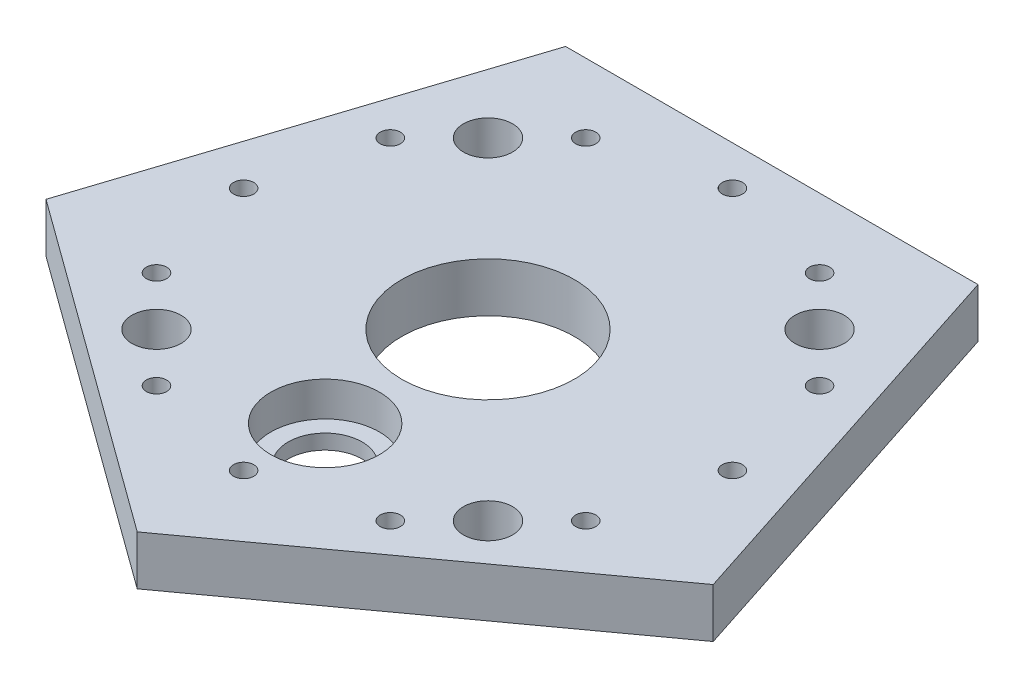
ISO-10303-21;
HEADER;
FILE_DESCRIPTION(('STEP AP214'),'2;1');
FILE_NAME('part.step','',(''),(''),'','','');
FILE_SCHEMA(('AUTOMOTIVE_DESIGN { 1 0 10303 214 1 1 1 1 }'));
ENDSEC;
DATA;
#1=APPLICATION_CONTEXT('core data for automotive mechanical design processes');
#2=APPLICATION_PROTOCOL_DEFINITION('international standard','automotive_design',2000,#1);
#3=PRODUCT_CONTEXT('',#1,'mechanical');
#4=PRODUCT('Part','Part','',(#3));
#5=PRODUCT_RELATED_PRODUCT_CATEGORY('part','',(#4));
#6=PRODUCT_DEFINITION_FORMATION('','',#4);
#7=PRODUCT_DEFINITION_CONTEXT('part definition',#1,'design');
#8=PRODUCT_DEFINITION('design','',#6,#7);
#9=PRODUCT_DEFINITION_SHAPE('','',#8);
#10=(LENGTH_UNIT() NAMED_UNIT(*) SI_UNIT(.MILLI.,.METRE.));
#11=(NAMED_UNIT(*) PLANE_ANGLE_UNIT() SI_UNIT($,.RADIAN.));
#12=(NAMED_UNIT(*) SI_UNIT($,.STERADIAN.) SOLID_ANGLE_UNIT());
#13=UNCERTAINTY_MEASURE_WITH_UNIT(LENGTH_MEASURE(1.E-05),#10,'distance_accuracy_value','');
#14=(GEOMETRIC_REPRESENTATION_CONTEXT(3) GLOBAL_UNCERTAINTY_ASSIGNED_CONTEXT((#13)) GLOBAL_UNIT_ASSIGNED_CONTEXT((#10,
#11,#12)) REPRESENTATION_CONTEXT('',''));
#15=CARTESIAN_POINT('',(0.,0.,0.));
#16=DIRECTION('',(0.,0.,1.));
#17=DIRECTION('',(1.,0.,0.));
#18=AXIS2_PLACEMENT_3D('',#15,#16,#17);
#19=CARTESIAN_POINT('',(-67.5953040136342,10.,21.9630456468817));
#20=DIRECTION('',(0.587785252292465,0.,-0.809016994374953));
#21=DIRECTION('',(-0.809016994374953,0.,-0.587785252292465));
#22=AXIS2_PLACEMENT_3D('',#19,#20,#21);
#23=PLANE('',#22);
#24=DIRECTION('',(0.809016994374953,0.,0.587785252292465));
#25=VECTOR('',#24,1.);
#26=CARTESIAN_POINT('',(-67.5953040136342,0.,21.9630456468817));
#27=LINE('',#26,#25);
#28=CARTESIAN_POINT('',(-67.5953040136342,0.,21.9630456468817));
#29=VERTEX_POINT('',#28);
#30=CARTESIAN_POINT('',(6.9310712247106E-13,0.,71.0739087062379));
#31=VERTEX_POINT('',#30);
#32=EDGE_CURVE('E106',#29,#31,#27,.T.);
#33=ORIENTED_EDGE('',*,*,#32,.T.);
#34=DIRECTION('',(0.,-1.,0.));
#35=VECTOR('',#34,1.);
#36=CARTESIAN_POINT('',(6.9310712247106E-13,10.,71.0739087062379));
#37=LINE('',#36,#35);
#38=CARTESIAN_POINT('',(6.9310712247106E-13,10.,71.0739087062379));
#39=VERTEX_POINT('',#38);
#40=EDGE_CURVE('E11',#39,#31,#37,.T.);
#41=ORIENTED_EDGE('',*,*,#40,.F.);
#42=DIRECTION('',(0.809016994374953,0.,0.587785252292465));
#43=VECTOR('',#42,1.);
#44=CARTESIAN_POINT('',(-67.5953040136342,10.,21.9630456468817));
#45=LINE('',#44,#43);
#46=CARTESIAN_POINT('',(-67.5953040136342,10.,21.9630456468817));
#47=VERTEX_POINT('',#46);
#48=EDGE_CURVE('E115',#47,#39,#45,.T.);
#49=ORIENTED_EDGE('',*,*,#48,.F.);
#50=DIRECTION('',(0.,-1.,0.));
#51=VECTOR('',#50,1.);
#52=CARTESIAN_POINT('',(-67.5953040136342,10.,21.9630456468817));
#53=LINE('',#52,#51);
#54=EDGE_CURVE('E102',#47,#29,#53,.T.);
#55=ORIENTED_EDGE('',*,*,#54,.T.);
#56=EDGE_LOOP('',(#33,#41,#49,#55));
#57=FACE_BOUND('',#56,.T.);
#58=ADVANCED_FACE('F32',(#57),#23,.F.);
#59=CARTESIAN_POINT('',(6.9310712247106E-13,10.,71.0739087062379));
#60=DIRECTION('',(-0.587785252292481,0.,-0.809016994374941));
#61=DIRECTION('',(-0.809016994374942,0.,0.587785252292481));
#62=AXIS2_PLACEMENT_3D('',#59,#60,#61);
#63=PLANE('',#62);
#64=DIRECTION('',(0.809016994374941,0.,-0.587785252292481));
#65=VECTOR('',#64,1.);
#66=CARTESIAN_POINT('',(6.9310712247106E-13,0.,71.0739087062379));
#67=LINE('',#66,#65);
#68=CARTESIAN_POINT('',(67.5953040136346,0.,21.9630456468804));
#69=VERTEX_POINT('',#68);
#70=EDGE_CURVE('E109',#31,#69,#67,.T.);
#71=ORIENTED_EDGE('',*,*,#70,.T.);
#72=DIRECTION('',(0.,-1.,0.));
#73=VECTOR('',#72,1.);
#74=CARTESIAN_POINT('',(67.5953040136346,10.,21.9630456468804));
#75=LINE('',#74,#73);
#76=CARTESIAN_POINT('',(67.5953040136346,10.,21.9630456468804));
#77=VERTEX_POINT('',#76);
#78=EDGE_CURVE('E40',#77,#69,#75,.T.);
#79=ORIENTED_EDGE('',*,*,#78,.F.);
#80=DIRECTION('',(0.809016994374941,0.,-0.587785252292481));
#81=VECTOR('',#80,1.);
#82=CARTESIAN_POINT('',(6.9310712247106E-13,10.,71.0739087062379));
#83=LINE('',#82,#81);
#84=EDGE_CURVE('E82',#39,#77,#83,.T.);
#85=ORIENTED_EDGE('',*,*,#84,.F.);
#86=ORIENTED_EDGE('',*,*,#40,.T.);
#87=EDGE_LOOP('',(#71,#79,#85,#86));
#88=FACE_BOUND('',#87,.T.);
#89=ADVANCED_FACE('F135',(#88),#63,.F.);
#90=CARTESIAN_POINT('',(67.5953040136346,10.,21.9630456468804));
#91=DIRECTION('',(-0.95105651629515,0.,0.309016994374957));
#92=DIRECTION('',(0.309016994374957,0.,0.95105651629515));
#93=AXIS2_PLACEMENT_3D('',#90,#91,#92);
#94=PLANE('',#93);
#95=DIRECTION('',(-0.309016994374957,0.,-0.95105651629515));
#96=VECTOR('',#95,1.);
#97=CARTESIAN_POINT('',(67.5953040136346,0.,21.9630456468804));
#98=LINE('',#97,#96);
#99=CARTESIAN_POINT('',(41.7761953603076,0.,-57.5000000000004));
#100=VERTEX_POINT('',#99);
#101=EDGE_CURVE('E97',#69,#100,#98,.T.);
#102=ORIENTED_EDGE('',*,*,#101,.T.);
#103=DIRECTION('',(0.,-1.,0.));
#104=VECTOR('',#103,1.);
#105=CARTESIAN_POINT('',(41.7761953603076,10.,-57.5000000000004));
#106=LINE('',#105,#104);
#107=CARTESIAN_POINT('',(41.7761953603076,10.,-57.5000000000004));
#108=VERTEX_POINT('',#107);
#109=EDGE_CURVE('E94',#108,#100,#106,.T.);
#110=ORIENTED_EDGE('',*,*,#109,.F.);
#111=DIRECTION('',(-0.309016994374957,0.,-0.95105651629515));
#112=VECTOR('',#111,1.);
#113=CARTESIAN_POINT('',(67.5953040136346,10.,21.9630456468804));
#114=LINE('',#113,#112);
#115=EDGE_CURVE('E86',#77,#108,#114,.T.);
#116=ORIENTED_EDGE('',*,*,#115,.F.);
#117=ORIENTED_EDGE('',*,*,#78,.T.);
#118=EDGE_LOOP('',(#102,#110,#116,#117));
#119=FACE_BOUND('',#118,.T.);
#120=ADVANCED_FACE('F95',(#119),#94,.F.);
#121=CARTESIAN_POINT('',(41.7761953603076,10.,-57.5000000000004));
#122=DIRECTION('',(0.,0.,1.));
#123=DIRECTION('',(1.,0.,0.));
#124=AXIS2_PLACEMENT_3D('',#121,#122,#123);
#125=PLANE('',#124);
#126=DIRECTION('',(-1.,0.,0.));
#127=VECTOR('',#126,1.);
#128=CARTESIAN_POINT('',(41.7761953603076,0.,-57.5000000000004));
#129=LINE('',#128,#127);
#130=CARTESIAN_POINT('',(-41.7761953603089,0.,-57.4999999999996));
#131=VERTEX_POINT('',#130);
#132=EDGE_CURVE('E68',#100,#131,#129,.T.);
#133=ORIENTED_EDGE('',*,*,#132,.T.);
#134=DIRECTION('',(0.,-1.,0.));
#135=VECTOR('',#134,1.);
#136=CARTESIAN_POINT('',(-41.7761953603089,10.,-57.4999999999996));
#137=LINE('',#136,#135);
#138=CARTESIAN_POINT('',(-41.7761953603089,10.,-57.4999999999996));
#139=VERTEX_POINT('',#138);
#140=EDGE_CURVE('E98',#139,#131,#137,.T.);
#141=ORIENTED_EDGE('',*,*,#140,.F.);
#142=DIRECTION('',(-1.,0.,0.));
#143=VECTOR('',#142,1.);
#144=CARTESIAN_POINT('',(41.7761953603076,10.,-57.5000000000004));
#145=LINE('',#144,#143);
#146=EDGE_CURVE('E90',#108,#139,#145,.T.);
#147=ORIENTED_EDGE('',*,*,#146,.F.);
#148=ORIENTED_EDGE('',*,*,#109,.T.);
#149=EDGE_LOOP('',(#133,#141,#147,#148));
#150=FACE_BOUND('',#149,.T.);
#151=ADVANCED_FACE('F100',(#150),#125,.F.);
#152=CARTESIAN_POINT('',(-41.7761953603089,10.,-57.4999999999996));
#153=DIRECTION('',(0.951056516295157,0.,0.309016994374938));
#154=DIRECTION('',(0.309016994374938,0.,-0.951056516295157));
#155=AXIS2_PLACEMENT_3D('',#152,#153,#154);
#156=PLANE('',#155);
#157=DIRECTION('',(-0.309016994374938,0.,0.951056516295157));
#158=VECTOR('',#157,1.);
#159=CARTESIAN_POINT('',(-41.7761953603089,0.,-57.4999999999996));
#160=LINE('',#159,#158);
#161=EDGE_CURVE('E74',#131,#29,#160,.T.);
#162=ORIENTED_EDGE('',*,*,#161,.T.);
#163=ORIENTED_EDGE('',*,*,#54,.F.);
#164=DIRECTION('',(-0.309016994374938,0.,0.951056516295157));
#165=VECTOR('',#164,1.);
#166=CARTESIAN_POINT('',(-41.7761953603089,10.,-57.4999999999996));
#167=LINE('',#166,#165);
#168=EDGE_CURVE('E48',#139,#47,#167,.T.);
#169=ORIENTED_EDGE('',*,*,#168,.F.);
#170=ORIENTED_EDGE('',*,*,#140,.T.);
#171=EDGE_LOOP('',(#162,#163,#169,#170));
#172=FACE_BOUND('',#171,.T.);
#173=ADVANCED_FACE('F123',(#172),#156,.F.);
#174=CARTESIAN_POINT('',(0.,10.,0.));
#175=DIRECTION('',(0.,1.,0.));
#176=DIRECTION('',(0.,0.,1.));
#177=AXIS2_PLACEMENT_3D('',#174,#175,#176);
#178=PLANE('',#177);
#179=CARTESIAN_POINT('',(0.,10.,0.));
#180=DIRECTION('',(0.,1.,0.));
#181=DIRECTION('',(0.,0.,1.));
#182=AXIS2_PLACEMENT_3D('',#179,#180,#181);
#183=CIRCLE('',#182,17.5);
#184=CARTESIAN_POINT('',(0.,10.,17.5));
#185=VERTEX_POINT('',#184);
#186=EDGE_CURVE('E377',#185,#185,#183,.T.);
#187=ORIENTED_EDGE('',*,*,#186,.F.);
#188=EDGE_LOOP('',(#187));
#189=FACE_BOUND('',#188,.T.);
#190=CARTESIAN_POINT('',(-49.52,10.,-1.72898155899512E-13));
#191=DIRECTION('',(0.,1.,0.));
#192=DIRECTION('',(-1.,0.,0.));
#193=AXIS2_PLACEMENT_3D('',#190,#191,#192);
#194=CIRCLE('',#193,2.05);
#195=CARTESIAN_POINT('',(-51.57,10.,-1.8005569264414E-13));
#196=VERTEX_POINT('',#195);
#197=EDGE_CURVE('E386',#196,#196,#194,.T.);
#198=ORIENTED_EDGE('',*,*,#197,.F.);
#199=EDGE_LOOP('',(#198));
#200=FACE_BOUND('',#199,.T.);
#201=CARTESIAN_POINT('',(0.,10.,-49.52));
#202=DIRECTION('',(0.,1.,0.));
#203=DIRECTION('',(0.,0.,-1.));
#204=AXIS2_PLACEMENT_3D('',#201,#202,#203);
#205=CIRCLE('',#204,2.05);
#206=CARTESIAN_POINT('',(0.,10.,-51.57));
#207=VERTEX_POINT('',#206);
#208=EDGE_CURVE('E392',#207,#207,#205,.T.);
#209=ORIENTED_EDGE('',*,*,#208,.F.);
#210=EDGE_LOOP('',(#209));
#211=FACE_BOUND('',#210,.T.);
#212=CARTESIAN_POINT('',(49.52,10.,5.18694467698536E-13));
#213=DIRECTION('',(0.,1.,0.));
#214=DIRECTION('',(1.,0.,0.));
#215=AXIS2_PLACEMENT_3D('',#212,#213,#214);
#216=CIRCLE('',#215,2.05);
#217=CARTESIAN_POINT('',(51.57,10.,5.40167077932421E-13));
#218=VERTEX_POINT('',#217);
#219=EDGE_CURVE('E379',#218,#218,#216,.T.);
#220=ORIENTED_EDGE('',*,*,#219,.F.);
#221=EDGE_LOOP('',(#220));
#222=FACE_BOUND('',#221,.T.);
#223=CARTESIAN_POINT('',(-23.6880771697492,10.,-43.4870670429728));
#224=DIRECTION('',(0.,1.,0.));
#225=DIRECTION('',(-1.,0.,0.));
#226=AXIS2_PLACEMENT_3D('',#223,#224,#225);
#227=CIRCLE('',#226,2.05);
#228=CARTESIAN_POINT('',(-25.7380771697492,10.,-43.4870670429728));
#229=VERTEX_POINT('',#228);
#230=EDGE_CURVE('E428',#229,#229,#227,.T.);
#231=ORIENTED_EDGE('',*,*,#230,.F.);
#232=EDGE_LOOP('',(#231));
#233=FACE_BOUND('',#232,.T.);
#234=CARTESIAN_POINT('',(-43.4870670429726,10.,-23.6880771697495));
#235=DIRECTION('',(0.,1.,0.));
#236=DIRECTION('',(-1.,0.,0.));
#237=AXIS2_PLACEMENT_3D('',#234,#235,#236);
#238=CIRCLE('',#237,2.05);
#239=CARTESIAN_POINT('',(-45.5370670429726,10.,-23.6880771697495));
#240=VERTEX_POINT('',#239);
#241=EDGE_CURVE('E434',#240,#240,#238,.T.);
#242=ORIENTED_EDGE('',*,*,#241,.F.);
#243=EDGE_LOOP('',(#242));
#244=FACE_BOUND('',#243,.T.);
#245=CARTESIAN_POINT('',(33.5875721063611,10.,-33.587572106361));
#246=DIRECTION('',(0.,1.,0.));
#247=DIRECTION('',(0.,0.,-1.));
#248=AXIS2_PLACEMENT_3D('',#245,#246,#247);
#249=CIRCLE('',#248,4.975);
#250=CARTESIAN_POINT('',(33.5875721063611,10.,-38.562572106361));
#251=VERTEX_POINT('',#250);
#252=EDGE_CURVE('E440',#251,#251,#249,.T.);
#253=ORIENTED_EDGE('',*,*,#252,.F.);
#254=EDGE_LOOP('',(#253));
#255=FACE_BOUND('',#254,.T.);
#256=CARTESIAN_POINT('',(43.4870670429727,10.,-23.6880771697493));
#257=DIRECTION('',(0.,1.,0.));
#258=DIRECTION('',(0.,0.,-1.));
#259=AXIS2_PLACEMENT_3D('',#256,#257,#258);
#260=CIRCLE('',#259,2.05);
#261=CARTESIAN_POINT('',(43.4870670429727,10.,-25.7380771697493));
#262=VERTEX_POINT('',#261);
#263=EDGE_CURVE('E415',#262,#262,#260,.T.);
#264=ORIENTED_EDGE('',*,*,#263,.F.);
#265=EDGE_LOOP('',(#264));
#266=FACE_BOUND('',#265,.T.);
#267=CARTESIAN_POINT('',(43.4870670429724,10.,23.6880771697498));
#268=DIRECTION('',(0.,1.,0.));
#269=DIRECTION('',(1.,0.,0.));
#270=AXIS2_PLACEMENT_3D('',#267,#268,#269);
#271=CIRCLE('',#270,2.05);
#272=CARTESIAN_POINT('',(45.5370670429724,10.,23.6880771697498));
#273=VERTEX_POINT('',#272);
#274=EDGE_CURVE('E385',#273,#273,#271,.T.);
#275=ORIENTED_EDGE('',*,*,#274,.F.);
#276=EDGE_LOOP('',(#275));
#277=FACE_BOUND('',#276,.T.);
#278=CARTESIAN_POINT('',(23.6880771697489,10.,43.4870670429729));
#279=DIRECTION('',(0.,1.,0.));
#280=DIRECTION('',(1.,0.,0.));
#281=AXIS2_PLACEMENT_3D('',#278,#279,#280);
#282=CIRCLE('',#281,2.05);
#283=CARTESIAN_POINT('',(25.7380771697489,10.,43.4870670429729));
#284=VERTEX_POINT('',#283);
#285=EDGE_CURVE('E404',#284,#284,#282,.T.);
#286=ORIENTED_EDGE('',*,*,#285,.F.);
#287=EDGE_LOOP('',(#286));
#288=FACE_BOUND('',#287,.T.);
#289=CARTESIAN_POINT('',(33.5875721063606,10.,33.5875721063614));
#290=DIRECTION('',(0.,1.,0.));
#291=DIRECTION('',(1.,0.,0.));
#292=AXIS2_PLACEMENT_3D('',#289,#290,#291);
#293=CIRCLE('',#292,4.975);
#294=CARTESIAN_POINT('',(38.5625721063606,10.,33.5875721063615));
#295=VERTEX_POINT('',#294);
#296=EDGE_CURVE('E403',#295,#295,#293,.T.);
#297=ORIENTED_EDGE('',*,*,#296,.F.);
#298=EDGE_LOOP('',(#297));
#299=FACE_BOUND('',#298,.T.);
#300=CARTESIAN_POINT('',(23.6880771697493,10.,-43.4870670429727));
#301=DIRECTION('',(0.,1.,0.));
#302=DIRECTION('',(0.,0.,-1.));
#303=AXIS2_PLACEMENT_3D('',#300,#301,#302);
#304=CIRCLE('',#303,2.05);
#305=CARTESIAN_POINT('',(23.6880771697493,10.,-45.5370670429727));
#306=VERTEX_POINT('',#305);
#307=EDGE_CURVE('E416',#306,#306,#304,.T.);
#308=ORIENTED_EDGE('',*,*,#307,.F.);
#309=EDGE_LOOP('',(#308));
#310=FACE_BOUND('',#309,.T.);
#311=CARTESIAN_POINT('',(-33.5875721063608,10.,-33.5875721063612));
#312=DIRECTION('',(0.,1.,0.));
#313=DIRECTION('',(-1.,0.,0.));
#314=AXIS2_PLACEMENT_3D('',#311,#312,#313);
#315=CIRCLE('',#314,4.975);
#316=CARTESIAN_POINT('',(-38.5625721063608,10.,-33.5875721063612));
#317=VERTEX_POINT('',#316);
#318=EDGE_CURVE('E427',#317,#317,#315,.T.);
#319=ORIENTED_EDGE('',*,*,#318,.F.);
#320=EDGE_LOOP('',(#319));
#321=FACE_BOUND('',#320,.T.);
#322=CARTESIAN_POINT('',(0.,10.,49.52));
#323=DIRECTION('',(0.,1.,0.));
#324=DIRECTION('',(0.,0.,1.));
#325=AXIS2_PLACEMENT_3D('',#322,#323,#324);
#326=CIRCLE('',#325,2.05);
#327=CARTESIAN_POINT('',(0.,10.,51.57));
#328=VERTEX_POINT('',#327);
#329=EDGE_CURVE('E451',#328,#328,#326,.T.);
#330=ORIENTED_EDGE('',*,*,#329,.F.);
#331=EDGE_LOOP('',(#330));
#332=FACE_BOUND('',#331,.T.);
#333=CARTESIAN_POINT('',(-23.6880771697493,10.,43.4870670429727));
#334=DIRECTION('',(0.,1.,0.));
#335=DIRECTION('',(0.,0.,1.));
#336=AXIS2_PLACEMENT_3D('',#333,#334,#335);
#337=CIRCLE('',#336,2.05);
#338=CARTESIAN_POINT('',(-23.6880771697493,10.,45.5370670429727));
#339=VERTEX_POINT('',#338);
#340=EDGE_CURVE('E457',#339,#339,#337,.T.);
#341=ORIENTED_EDGE('',*,*,#340,.F.);
#342=EDGE_LOOP('',(#341));
#343=FACE_BOUND('',#342,.T.);
#344=CARTESIAN_POINT('',(-43.4870670429727,10.,23.6880771697493));
#345=DIRECTION('',(0.,1.,0.));
#346=DIRECTION('',(0.,0.,1.));
#347=AXIS2_PLACEMENT_3D('',#344,#345,#346);
#348=CIRCLE('',#347,2.05);
#349=CARTESIAN_POINT('',(-43.4870670429727,10.,25.7380771697493));
#350=VERTEX_POINT('',#349);
#351=EDGE_CURVE('E464',#350,#350,#348,.T.);
#352=ORIENTED_EDGE('',*,*,#351,.F.);
#353=EDGE_LOOP('',(#352));
#354=FACE_BOUND('',#353,.T.);
#355=CARTESIAN_POINT('',(-33.5875721063611,10.,33.587572106361));
#356=DIRECTION('',(0.,1.,0.));
#357=DIRECTION('',(0.,0.,1.));
#358=AXIS2_PLACEMENT_3D('',#355,#356,#357);
#359=CIRCLE('',#358,4.975);
#360=CARTESIAN_POINT('',(-33.5875721063611,10.,38.562572106361));
#361=VERTEX_POINT('',#360);
#362=EDGE_CURVE('E463',#361,#361,#359,.T.);
#363=ORIENTED_EDGE('',*,*,#362,.F.);
#364=EDGE_LOOP('',(#363));
#365=FACE_BOUND('',#364,.T.);
#366=CARTESIAN_POINT('',(0.,10.,33.));
#367=DIRECTION('',(0.,1.,0.));
#368=DIRECTION('',(0.,0.,1.));
#369=AXIS2_PLACEMENT_3D('',#366,#367,#368);
#370=CIRCLE('',#369,11.);
#371=CARTESIAN_POINT('',(0.,10.,44.));
#372=VERTEX_POINT('',#371);
#373=EDGE_CURVE('E481',#372,#372,#370,.T.);
#374=ORIENTED_EDGE('',*,*,#373,.F.);
#375=EDGE_LOOP('',(#374));
#376=FACE_BOUND('',#375,.T.);
#377=ORIENTED_EDGE('',*,*,#48,.T.);
#378=ORIENTED_EDGE('',*,*,#84,.T.);
#379=ORIENTED_EDGE('',*,*,#115,.T.);
#380=ORIENTED_EDGE('',*,*,#146,.T.);
#381=ORIENTED_EDGE('',*,*,#168,.T.);
#382=EDGE_LOOP('',(#377,#378,#379,#380,#381));
#383=FACE_BOUND('',#382,.T.);
#384=ADVANCED_FACE('F88',(#189,#200,#211,#222,#233,#244,#255,#266,#277,#288,#299,#310,#321,#332,
#343,#354,#365,#376,#383),#178,.T.);
#385=CARTESIAN_POINT('',(0.,0.,0.));
#386=DIRECTION('',(0.,1.,0.));
#387=DIRECTION('',(0.,0.,1.));
#388=AXIS2_PLACEMENT_3D('',#385,#386,#387);
#389=PLANE('',#388);
#390=CARTESIAN_POINT('',(0.,0.,0.));
#391=DIRECTION('',(0.,1.,0.));
#392=DIRECTION('',(0.,0.,1.));
#393=AXIS2_PLACEMENT_3D('',#390,#391,#392);
#394=CIRCLE('',#393,17.5);
#395=CARTESIAN_POINT('',(0.,0.,17.5));
#396=VERTEX_POINT('',#395);
#397=EDGE_CURVE('E374',#396,#396,#394,.T.);
#398=ORIENTED_EDGE('',*,*,#397,.T.);
#399=EDGE_LOOP('',(#398));
#400=FACE_BOUND('',#399,.T.);
#401=CARTESIAN_POINT('',(-49.52,0.,-1.72898155899512E-13));
#402=DIRECTION('',(0.,1.,0.));
#403=DIRECTION('',(-1.,0.,0.));
#404=AXIS2_PLACEMENT_3D('',#401,#402,#403);
#405=CIRCLE('',#404,2.05);
#406=CARTESIAN_POINT('',(-51.57,0.,-1.8005569264414E-13));
#407=VERTEX_POINT('',#406);
#408=EDGE_CURVE('E382',#407,#407,#405,.T.);
#409=ORIENTED_EDGE('',*,*,#408,.T.);
#410=EDGE_LOOP('',(#409));
#411=FACE_BOUND('',#410,.T.);
#412=CARTESIAN_POINT('',(0.,0.,-49.52));
#413=DIRECTION('',(0.,1.,0.));
#414=DIRECTION('',(0.,0.,-1.));
#415=AXIS2_PLACEMENT_3D('',#412,#413,#414);
#416=CIRCLE('',#415,2.05);
#417=CARTESIAN_POINT('',(0.,0.,-51.57));
#418=VERTEX_POINT('',#417);
#419=EDGE_CURVE('E389',#418,#418,#416,.T.);
#420=ORIENTED_EDGE('',*,*,#419,.T.);
#421=EDGE_LOOP('',(#420));
#422=FACE_BOUND('',#421,.T.);
#423=CARTESIAN_POINT('',(49.52,0.,5.18694467698536E-13));
#424=DIRECTION('',(0.,1.,0.));
#425=DIRECTION('',(1.,0.,0.));
#426=AXIS2_PLACEMENT_3D('',#423,#424,#425);
#427=CIRCLE('',#426,2.05);
#428=CARTESIAN_POINT('',(51.57,0.,5.40167077932421E-13));
#429=VERTEX_POINT('',#428);
#430=EDGE_CURVE('E395',#429,#429,#427,.T.);
#431=ORIENTED_EDGE('',*,*,#430,.T.);
#432=EDGE_LOOP('',(#431));
#433=FACE_BOUND('',#432,.T.);
#434=CARTESIAN_POINT('',(-23.6880771697492,0.,-43.4870670429728));
#435=DIRECTION('',(0.,1.,0.));
#436=DIRECTION('',(-1.,0.,0.));
#437=AXIS2_PLACEMENT_3D('',#434,#435,#436);
#438=CIRCLE('',#437,2.05);
#439=CARTESIAN_POINT('',(-25.7380771697492,0.,-43.4870670429728));
#440=VERTEX_POINT('',#439);
#441=EDGE_CURVE('E424',#440,#440,#438,.T.);
#442=ORIENTED_EDGE('',*,*,#441,.T.);
#443=EDGE_LOOP('',(#442));
#444=FACE_BOUND('',#443,.T.);
#445=CARTESIAN_POINT('',(-43.4870670429726,0.,-23.6880771697495));
#446=DIRECTION('',(0.,1.,0.));
#447=DIRECTION('',(-1.,0.,0.));
#448=AXIS2_PLACEMENT_3D('',#445,#446,#447);
#449=CIRCLE('',#448,2.05);
#450=CARTESIAN_POINT('',(-45.5370670429726,0.,-23.6880771697495));
#451=VERTEX_POINT('',#450);
#452=EDGE_CURVE('E431',#451,#451,#449,.T.);
#453=ORIENTED_EDGE('',*,*,#452,.T.);
#454=EDGE_LOOP('',(#453));
#455=FACE_BOUND('',#454,.T.);
#456=CARTESIAN_POINT('',(33.5875721063611,0.,-33.587572106361));
#457=DIRECTION('',(0.,1.,0.));
#458=DIRECTION('',(0.,0.,-1.));
#459=AXIS2_PLACEMENT_3D('',#456,#457,#458);
#460=CIRCLE('',#459,4.975);
#461=CARTESIAN_POINT('',(33.5875721063611,0.,-38.562572106361));
#462=VERTEX_POINT('',#461);
#463=EDGE_CURVE('E437',#462,#462,#460,.T.);
#464=ORIENTED_EDGE('',*,*,#463,.T.);
#465=EDGE_LOOP('',(#464));
#466=FACE_BOUND('',#465,.T.);
#467=CARTESIAN_POINT('',(43.4870670429727,0.,-23.6880771697493));
#468=DIRECTION('',(0.,1.,0.));
#469=DIRECTION('',(0.,0.,-1.));
#470=AXIS2_PLACEMENT_3D('',#467,#468,#469);
#471=CIRCLE('',#470,2.05);
#472=CARTESIAN_POINT('',(43.4870670429727,0.,-25.7380771697493));
#473=VERTEX_POINT('',#472);
#474=EDGE_CURVE('E443',#473,#473,#471,.T.);
#475=ORIENTED_EDGE('',*,*,#474,.T.);
#476=EDGE_LOOP('',(#475));
#477=FACE_BOUND('',#476,.T.);
#478=CARTESIAN_POINT('',(43.4870670429724,0.,23.6880771697498));
#479=DIRECTION('',(0.,1.,0.));
#480=DIRECTION('',(1.,0.,0.));
#481=AXIS2_PLACEMENT_3D('',#478,#479,#480);
#482=CIRCLE('',#481,2.05);
#483=CARTESIAN_POINT('',(45.5370670429724,0.,23.6880771697498));
#484=VERTEX_POINT('',#483);
#485=EDGE_CURVE('E407',#484,#484,#482,.T.);
#486=ORIENTED_EDGE('',*,*,#485,.T.);
#487=EDGE_LOOP('',(#486));
#488=FACE_BOUND('',#487,.T.);
#489=CARTESIAN_POINT('',(23.6880771697489,0.,43.4870670429729));
#490=DIRECTION('',(0.,1.,0.));
#491=DIRECTION('',(1.,0.,0.));
#492=AXIS2_PLACEMENT_3D('',#489,#490,#491);
#493=CIRCLE('',#492,2.05);
#494=CARTESIAN_POINT('',(25.7380771697489,0.,43.4870670429729));
#495=VERTEX_POINT('',#494);
#496=EDGE_CURVE('E400',#495,#495,#493,.T.);
#497=ORIENTED_EDGE('',*,*,#496,.T.);
#498=EDGE_LOOP('',(#497));
#499=FACE_BOUND('',#498,.T.);
#500=CARTESIAN_POINT('',(33.5875721063606,0.,33.5875721063614));
#501=DIRECTION('',(0.,1.,0.));
#502=DIRECTION('',(1.,0.,0.));
#503=AXIS2_PLACEMENT_3D('',#500,#501,#502);
#504=CIRCLE('',#503,4.975);
#505=CARTESIAN_POINT('',(38.5625721063606,0.,33.5875721063615));
#506=VERTEX_POINT('',#505);
#507=EDGE_CURVE('E419',#506,#506,#504,.T.);
#508=ORIENTED_EDGE('',*,*,#507,.T.);
#509=EDGE_LOOP('',(#508));
#510=FACE_BOUND('',#509,.T.);
#511=CARTESIAN_POINT('',(23.6880771697493,0.,-43.4870670429727));
#512=DIRECTION('',(0.,1.,0.));
#513=DIRECTION('',(0.,0.,-1.));
#514=AXIS2_PLACEMENT_3D('',#511,#512,#513);
#515=CIRCLE('',#514,2.05);
#516=CARTESIAN_POINT('',(23.6880771697493,0.,-45.5370670429727));
#517=VERTEX_POINT('',#516);
#518=EDGE_CURVE('E412',#517,#517,#515,.T.);
#519=ORIENTED_EDGE('',*,*,#518,.T.);
#520=EDGE_LOOP('',(#519));
#521=FACE_BOUND('',#520,.T.);
#522=CARTESIAN_POINT('',(-33.5875721063608,0.,-33.5875721063612));
#523=DIRECTION('',(0.,1.,0.));
#524=DIRECTION('',(-1.,0.,0.));
#525=AXIS2_PLACEMENT_3D('',#522,#523,#524);
#526=CIRCLE('',#525,4.975);
#527=CARTESIAN_POINT('',(-38.5625721063608,0.,-33.5875721063612));
#528=VERTEX_POINT('',#527);
#529=EDGE_CURVE('E448',#528,#528,#526,.T.);
#530=ORIENTED_EDGE('',*,*,#529,.T.);
#531=EDGE_LOOP('',(#530));
#532=FACE_BOUND('',#531,.T.);
#533=CARTESIAN_POINT('',(0.,0.,49.52));
#534=DIRECTION('',(0.,1.,0.));
#535=DIRECTION('',(0.,0.,1.));
#536=AXIS2_PLACEMENT_3D('',#533,#534,#535);
#537=CIRCLE('',#536,2.05);
#538=CARTESIAN_POINT('',(0.,0.,51.57));
#539=VERTEX_POINT('',#538);
#540=EDGE_CURVE('E454',#539,#539,#537,.T.);
#541=ORIENTED_EDGE('',*,*,#540,.T.);
#542=EDGE_LOOP('',(#541));
#543=FACE_BOUND('',#542,.T.);
#544=CARTESIAN_POINT('',(-23.6880771697493,0.,43.4870670429727));
#545=DIRECTION('',(0.,1.,0.));
#546=DIRECTION('',(0.,0.,1.));
#547=AXIS2_PLACEMENT_3D('',#544,#545,#546);
#548=CIRCLE('',#547,2.05);
#549=CARTESIAN_POINT('',(-23.6880771697493,0.,45.5370670429727));
#550=VERTEX_POINT('',#549);
#551=EDGE_CURVE('E467',#550,#550,#548,.T.);
#552=ORIENTED_EDGE('',*,*,#551,.T.);
#553=EDGE_LOOP('',(#552));
#554=FACE_BOUND('',#553,.T.);
#555=CARTESIAN_POINT('',(-43.4870670429727,0.,23.6880771697493));
#556=DIRECTION('',(0.,1.,0.));
#557=DIRECTION('',(0.,0.,1.));
#558=AXIS2_PLACEMENT_3D('',#555,#556,#557);
#559=CIRCLE('',#558,2.05);
#560=CARTESIAN_POINT('',(-43.4870670429727,0.,25.7380771697493));
#561=VERTEX_POINT('',#560);
#562=EDGE_CURVE('E460',#561,#561,#559,.T.);
#563=ORIENTED_EDGE('',*,*,#562,.T.);
#564=EDGE_LOOP('',(#563));
#565=FACE_BOUND('',#564,.T.);
#566=CARTESIAN_POINT('',(-33.5875721063611,0.,33.587572106361));
#567=DIRECTION('',(0.,1.,0.));
#568=DIRECTION('',(0.,0.,1.));
#569=AXIS2_PLACEMENT_3D('',#566,#567,#568);
#570=CIRCLE('',#569,4.975);
#571=CARTESIAN_POINT('',(-33.5875721063611,0.,38.562572106361));
#572=VERTEX_POINT('',#571);
#573=EDGE_CURVE('E472',#572,#572,#570,.T.);
#574=ORIENTED_EDGE('',*,*,#573,.T.);
#575=EDGE_LOOP('',(#574));
#576=FACE_BOUND('',#575,.T.);
#577=CARTESIAN_POINT('',(0.,0.,33.));
#578=DIRECTION('',(0.,1.,0.));
#579=DIRECTION('',(0.,0.,1.));
#580=AXIS2_PLACEMENT_3D('',#577,#578,#579);
#581=CIRCLE('',#580,7.5);
#582=CARTESIAN_POINT('',(0.,0.,40.5));
#583=VERTEX_POINT('',#582);
#584=EDGE_CURVE('E478',#583,#583,#581,.T.);
#585=ORIENTED_EDGE('',*,*,#584,.T.);
#586=EDGE_LOOP('',(#585));
#587=FACE_BOUND('',#586,.T.);
#588=ORIENTED_EDGE('',*,*,#32,.F.);
#589=ORIENTED_EDGE('',*,*,#161,.F.);
#590=ORIENTED_EDGE('',*,*,#132,.F.);
#591=ORIENTED_EDGE('',*,*,#101,.F.);
#592=ORIENTED_EDGE('',*,*,#70,.F.);
#593=EDGE_LOOP('',(#588,#589,#590,#591,#592));
#594=FACE_BOUND('',#593,.T.);
#595=ADVANCED_FACE('F119',(#400,#411,#422,#433,#444,#455,#466,#477,#488,#499,#510,#521,#532,
#543,#554,#565,#576,#587,#594),#389,.F.);
#596=CARTESIAN_POINT('',(0.,3.,33.));
#597=DIRECTION('',(0.,1.,0.));
#598=DIRECTION('',(0.,0.,1.));
#599=AXIS2_PLACEMENT_3D('',#596,#597,#598);
#600=CYLINDRICAL_SURFACE('',#599,11.);
#601=CARTESIAN_POINT('',(0.,3.,33.));
#602=DIRECTION('',(0.,1.,0.));
#603=DIRECTION('',(0.,0.,1.));
#604=AXIS2_PLACEMENT_3D('',#601,#602,#603);
#605=CIRCLE('',#604,11.);
#606=CARTESIAN_POINT('',(0.,3.,44.));
#607=VERTEX_POINT('',#606);
#608=EDGE_CURVE('E110',#607,#607,#605,.T.);
#609=ORIENTED_EDGE('',*,*,#608,.F.);
#610=EDGE_LOOP('',(#609));
#611=FACE_BOUND('',#610,.T.);
#612=ORIENTED_EDGE('',*,*,#373,.T.);
#613=EDGE_LOOP('',(#612));
#614=FACE_BOUND('',#613,.T.);
#615=ADVANCED_FACE('F159',(#611,#614),#600,.F.);
#616=CARTESIAN_POINT('',(0.,3.,33.));
#617=DIRECTION('',(0.,1.,0.));
#618=DIRECTION('',(0.,0.,1.));
#619=AXIS2_PLACEMENT_3D('',#616,#617,#618);
#620=PLANE('',#619);
#621=CARTESIAN_POINT('',(0.,3.,33.));
#622=DIRECTION('',(0.,1.,0.));
#623=DIRECTION('',(0.,0.,1.));
#624=AXIS2_PLACEMENT_3D('',#621,#622,#623);
#625=CIRCLE('',#624,7.5);
#626=CARTESIAN_POINT('',(0.,3.,40.5));
#627=VERTEX_POINT('',#626);
#628=EDGE_CURVE('E475',#627,#627,#625,.T.);
#629=ORIENTED_EDGE('',*,*,#628,.F.);
#630=EDGE_LOOP('',(#629));
#631=FACE_BOUND('',#630,.T.);
#632=ORIENTED_EDGE('',*,*,#608,.T.);
#633=EDGE_LOOP('',(#632));
#634=FACE_BOUND('',#633,.T.);
#635=ADVANCED_FACE('F164',(#631,#634),#620,.T.);
#636=CARTESIAN_POINT('',(0.,0.,33.));
#637=DIRECTION('',(0.,1.,0.));
#638=DIRECTION('',(0.,0.,1.));
#639=AXIS2_PLACEMENT_3D('',#636,#637,#638);
#640=CYLINDRICAL_SURFACE('',#639,7.5);
#641=ORIENTED_EDGE('',*,*,#584,.F.);
#642=EDGE_LOOP('',(#641));
#643=FACE_BOUND('',#642,.T.);
#644=ORIENTED_EDGE('',*,*,#628,.T.);
#645=EDGE_LOOP('',(#644));
#646=FACE_BOUND('',#645,.T.);
#647=ADVANCED_FACE('F176',(#643,#646),#640,.F.);
#648=CARTESIAN_POINT('',(-33.5875721063611,0.,33.587572106361));
#649=DIRECTION('',(0.,1.,0.));
#650=DIRECTION('',(0.,0.,1.));
#651=AXIS2_PLACEMENT_3D('',#648,#649,#650);
#652=CYLINDRICAL_SURFACE('',#651,4.975);
#653=ORIENTED_EDGE('',*,*,#573,.F.);
#654=EDGE_LOOP('',(#653));
#655=FACE_BOUND('',#654,.T.);
#656=ORIENTED_EDGE('',*,*,#362,.T.);
#657=EDGE_LOOP('',(#656));
#658=FACE_BOUND('',#657,.T.);
#659=ADVANCED_FACE('F186',(#655,#658),#652,.F.);
#660=CARTESIAN_POINT('',(-43.4870670429727,0.,23.6880771697493));
#661=DIRECTION('',(0.,1.,0.));
#662=DIRECTION('',(0.,0.,1.));
#663=AXIS2_PLACEMENT_3D('',#660,#661,#662);
#664=CYLINDRICAL_SURFACE('',#663,2.05);
#665=ORIENTED_EDGE('',*,*,#562,.F.);
#666=EDGE_LOOP('',(#665));
#667=FACE_BOUND('',#666,.T.);
#668=ORIENTED_EDGE('',*,*,#351,.T.);
#669=EDGE_LOOP('',(#668));
#670=FACE_BOUND('',#669,.T.);
#671=ADVANCED_FACE('F196',(#667,#670),#664,.F.);
#672=CARTESIAN_POINT('',(-23.6880771697493,0.,43.4870670429727));
#673=DIRECTION('',(0.,1.,0.));
#674=DIRECTION('',(0.,0.,1.));
#675=AXIS2_PLACEMENT_3D('',#672,#673,#674);
#676=CYLINDRICAL_SURFACE('',#675,2.05);
#677=ORIENTED_EDGE('',*,*,#551,.F.);
#678=EDGE_LOOP('',(#677));
#679=FACE_BOUND('',#678,.T.);
#680=ORIENTED_EDGE('',*,*,#340,.T.);
#681=EDGE_LOOP('',(#680));
#682=FACE_BOUND('',#681,.T.);
#683=ADVANCED_FACE('F206',(#679,#682),#676,.F.);
#684=CARTESIAN_POINT('',(0.,0.,49.52));
#685=DIRECTION('',(0.,1.,0.));
#686=DIRECTION('',(0.,0.,1.));
#687=AXIS2_PLACEMENT_3D('',#684,#685,#686);
#688=CYLINDRICAL_SURFACE('',#687,2.05);
#689=ORIENTED_EDGE('',*,*,#540,.F.);
#690=EDGE_LOOP('',(#689));
#691=FACE_BOUND('',#690,.T.);
#692=ORIENTED_EDGE('',*,*,#329,.T.);
#693=EDGE_LOOP('',(#692));
#694=FACE_BOUND('',#693,.T.);
#695=ADVANCED_FACE('F216',(#691,#694),#688,.F.);
#696=CARTESIAN_POINT('',(-33.5875721063608,0.,-33.5875721063612));
#697=DIRECTION('',(0.,1.,0.));
#698=DIRECTION('',(0.,0.,1.));
#699=AXIS2_PLACEMENT_3D('',#696,#697,#698);
#700=CYLINDRICAL_SURFACE('',#699,4.975);
#701=ORIENTED_EDGE('',*,*,#529,.F.);
#702=EDGE_LOOP('',(#701));
#703=FACE_BOUND('',#702,.T.);
#704=ORIENTED_EDGE('',*,*,#318,.T.);
#705=EDGE_LOOP('',(#704));
#706=FACE_BOUND('',#705,.T.);
#707=ADVANCED_FACE('F226',(#703,#706),#700,.F.);
#708=CARTESIAN_POINT('',(23.6880771697493,0.,-43.4870670429727));
#709=DIRECTION('',(0.,1.,0.));
#710=DIRECTION('',(0.,0.,1.));
#711=AXIS2_PLACEMENT_3D('',#708,#709,#710);
#712=CYLINDRICAL_SURFACE('',#711,2.05);
#713=ORIENTED_EDGE('',*,*,#518,.F.);
#714=EDGE_LOOP('',(#713));
#715=FACE_BOUND('',#714,.T.);
#716=ORIENTED_EDGE('',*,*,#307,.T.);
#717=EDGE_LOOP('',(#716));
#718=FACE_BOUND('',#717,.T.);
#719=ADVANCED_FACE('F236',(#715,#718),#712,.F.);
#720=CARTESIAN_POINT('',(33.5875721063606,0.,33.5875721063614));
#721=DIRECTION('',(0.,1.,0.));
#722=DIRECTION('',(0.,0.,1.));
#723=AXIS2_PLACEMENT_3D('',#720,#721,#722);
#724=CYLINDRICAL_SURFACE('',#723,4.975);
#725=ORIENTED_EDGE('',*,*,#507,.F.);
#726=EDGE_LOOP('',(#725));
#727=FACE_BOUND('',#726,.T.);
#728=ORIENTED_EDGE('',*,*,#296,.T.);
#729=EDGE_LOOP('',(#728));
#730=FACE_BOUND('',#729,.T.);
#731=ADVANCED_FACE('F246',(#727,#730),#724,.F.);
#732=CARTESIAN_POINT('',(23.6880771697489,0.,43.4870670429729));
#733=DIRECTION('',(0.,1.,0.));
#734=DIRECTION('',(0.,0.,1.));
#735=AXIS2_PLACEMENT_3D('',#732,#733,#734);
#736=CYLINDRICAL_SURFACE('',#735,2.05);
#737=ORIENTED_EDGE('',*,*,#496,.F.);
#738=EDGE_LOOP('',(#737));
#739=FACE_BOUND('',#738,.T.);
#740=ORIENTED_EDGE('',*,*,#285,.T.);
#741=EDGE_LOOP('',(#740));
#742=FACE_BOUND('',#741,.T.);
#743=ADVANCED_FACE('F256',(#739,#742),#736,.F.);
#744=CARTESIAN_POINT('',(43.4870670429724,0.,23.6880771697498));
#745=DIRECTION('',(0.,1.,0.));
#746=DIRECTION('',(0.,0.,1.));
#747=AXIS2_PLACEMENT_3D('',#744,#745,#746);
#748=CYLINDRICAL_SURFACE('',#747,2.05);
#749=ORIENTED_EDGE('',*,*,#485,.F.);
#750=EDGE_LOOP('',(#749));
#751=FACE_BOUND('',#750,.T.);
#752=ORIENTED_EDGE('',*,*,#274,.T.);
#753=EDGE_LOOP('',(#752));
#754=FACE_BOUND('',#753,.T.);
#755=ADVANCED_FACE('F266',(#751,#754),#748,.F.);
#756=CARTESIAN_POINT('',(43.4870670429727,0.,-23.6880771697493));
#757=DIRECTION('',(0.,1.,0.));
#758=DIRECTION('',(0.,0.,1.));
#759=AXIS2_PLACEMENT_3D('',#756,#757,#758);
#760=CYLINDRICAL_SURFACE('',#759,2.05);
#761=ORIENTED_EDGE('',*,*,#474,.F.);
#762=EDGE_LOOP('',(#761));
#763=FACE_BOUND('',#762,.T.);
#764=ORIENTED_EDGE('',*,*,#263,.T.);
#765=EDGE_LOOP('',(#764));
#766=FACE_BOUND('',#765,.T.);
#767=ADVANCED_FACE('F276',(#763,#766),#760,.F.);
#768=CARTESIAN_POINT('',(33.5875721063611,0.,-33.587572106361));
#769=DIRECTION('',(0.,1.,0.));
#770=DIRECTION('',(0.,0.,1.));
#771=AXIS2_PLACEMENT_3D('',#768,#769,#770);
#772=CYLINDRICAL_SURFACE('',#771,4.975);
#773=ORIENTED_EDGE('',*,*,#463,.F.);
#774=EDGE_LOOP('',(#773));
#775=FACE_BOUND('',#774,.T.);
#776=ORIENTED_EDGE('',*,*,#252,.T.);
#777=EDGE_LOOP('',(#776));
#778=FACE_BOUND('',#777,.T.);
#779=ADVANCED_FACE('F286',(#775,#778),#772,.F.);
#780=CARTESIAN_POINT('',(-43.4870670429726,0.,-23.6880771697495));
#781=DIRECTION('',(0.,1.,0.));
#782=DIRECTION('',(0.,0.,1.));
#783=AXIS2_PLACEMENT_3D('',#780,#781,#782);
#784=CYLINDRICAL_SURFACE('',#783,2.05);
#785=ORIENTED_EDGE('',*,*,#452,.F.);
#786=EDGE_LOOP('',(#785));
#787=FACE_BOUND('',#786,.T.);
#788=ORIENTED_EDGE('',*,*,#241,.T.);
#789=EDGE_LOOP('',(#788));
#790=FACE_BOUND('',#789,.T.);
#791=ADVANCED_FACE('F296',(#787,#790),#784,.F.);
#792=CARTESIAN_POINT('',(-23.6880771697492,0.,-43.4870670429728));
#793=DIRECTION('',(0.,1.,0.));
#794=DIRECTION('',(0.,0.,1.));
#795=AXIS2_PLACEMENT_3D('',#792,#793,#794);
#796=CYLINDRICAL_SURFACE('',#795,2.05);
#797=ORIENTED_EDGE('',*,*,#441,.F.);
#798=EDGE_LOOP('',(#797));
#799=FACE_BOUND('',#798,.T.);
#800=ORIENTED_EDGE('',*,*,#230,.T.);
#801=EDGE_LOOP('',(#800));
#802=FACE_BOUND('',#801,.T.);
#803=ADVANCED_FACE('F306',(#799,#802),#796,.F.);
#804=CARTESIAN_POINT('',(49.52,0.,5.18694467698536E-13));
#805=DIRECTION('',(0.,1.,0.));
#806=DIRECTION('',(0.,0.,1.));
#807=AXIS2_PLACEMENT_3D('',#804,#805,#806);
#808=CYLINDRICAL_SURFACE('',#807,2.05);
#809=ORIENTED_EDGE('',*,*,#430,.F.);
#810=EDGE_LOOP('',(#809));
#811=FACE_BOUND('',#810,.T.);
#812=ORIENTED_EDGE('',*,*,#219,.T.);
#813=EDGE_LOOP('',(#812));
#814=FACE_BOUND('',#813,.T.);
#815=ADVANCED_FACE('F316',(#811,#814),#808,.F.);
#816=CARTESIAN_POINT('',(0.,0.,-49.52));
#817=DIRECTION('',(0.,1.,0.));
#818=DIRECTION('',(0.,0.,1.));
#819=AXIS2_PLACEMENT_3D('',#816,#817,#818);
#820=CYLINDRICAL_SURFACE('',#819,2.05);
#821=ORIENTED_EDGE('',*,*,#419,.F.);
#822=EDGE_LOOP('',(#821));
#823=FACE_BOUND('',#822,.T.);
#824=ORIENTED_EDGE('',*,*,#208,.T.);
#825=EDGE_LOOP('',(#824));
#826=FACE_BOUND('',#825,.T.);
#827=ADVANCED_FACE('F326',(#823,#826),#820,.F.);
#828=CARTESIAN_POINT('',(-49.52,0.,-1.72898155899512E-13));
#829=DIRECTION('',(0.,1.,0.));
#830=DIRECTION('',(0.,0.,1.));
#831=AXIS2_PLACEMENT_3D('',#828,#829,#830);
#832=CYLINDRICAL_SURFACE('',#831,2.05);
#833=ORIENTED_EDGE('',*,*,#408,.F.);
#834=EDGE_LOOP('',(#833));
#835=FACE_BOUND('',#834,.T.);
#836=ORIENTED_EDGE('',*,*,#197,.T.);
#837=EDGE_LOOP('',(#836));
#838=FACE_BOUND('',#837,.T.);
#839=ADVANCED_FACE('F336',(#835,#838),#832,.F.);
#840=CARTESIAN_POINT('',(0.,0.,0.));
#841=DIRECTION('',(0.,1.,0.));
#842=DIRECTION('',(0.,0.,1.));
#843=AXIS2_PLACEMENT_3D('',#840,#841,#842);
#844=CYLINDRICAL_SURFACE('',#843,17.5);
#845=ORIENTED_EDGE('',*,*,#397,.F.);
#846=EDGE_LOOP('',(#845));
#847=FACE_BOUND('',#846,.T.);
#848=ORIENTED_EDGE('',*,*,#186,.T.);
#849=EDGE_LOOP('',(#848));
#850=FACE_BOUND('',#849,.T.);
#851=ADVANCED_FACE('F346',(#847,#850),#844,.F.);
#852=CLOSED_SHELL('',(#58,#89,#120,#151,#173,#384,#595,#615,#635,#647,#659,#671,#683,#695,#707,
#719,#731,#743,#755,#767,#779,#791,#803,#815,#827,#839,#851));
#853=MANIFOLD_SOLID_BREP('B2',#852);
#854=ADVANCED_BREP_SHAPE_REPRESENTATION('',(#18,#853),#14);
#855=SHAPE_DEFINITION_REPRESENTATION(#9,#854);
ENDSEC;
END-ISO-10303-21;
